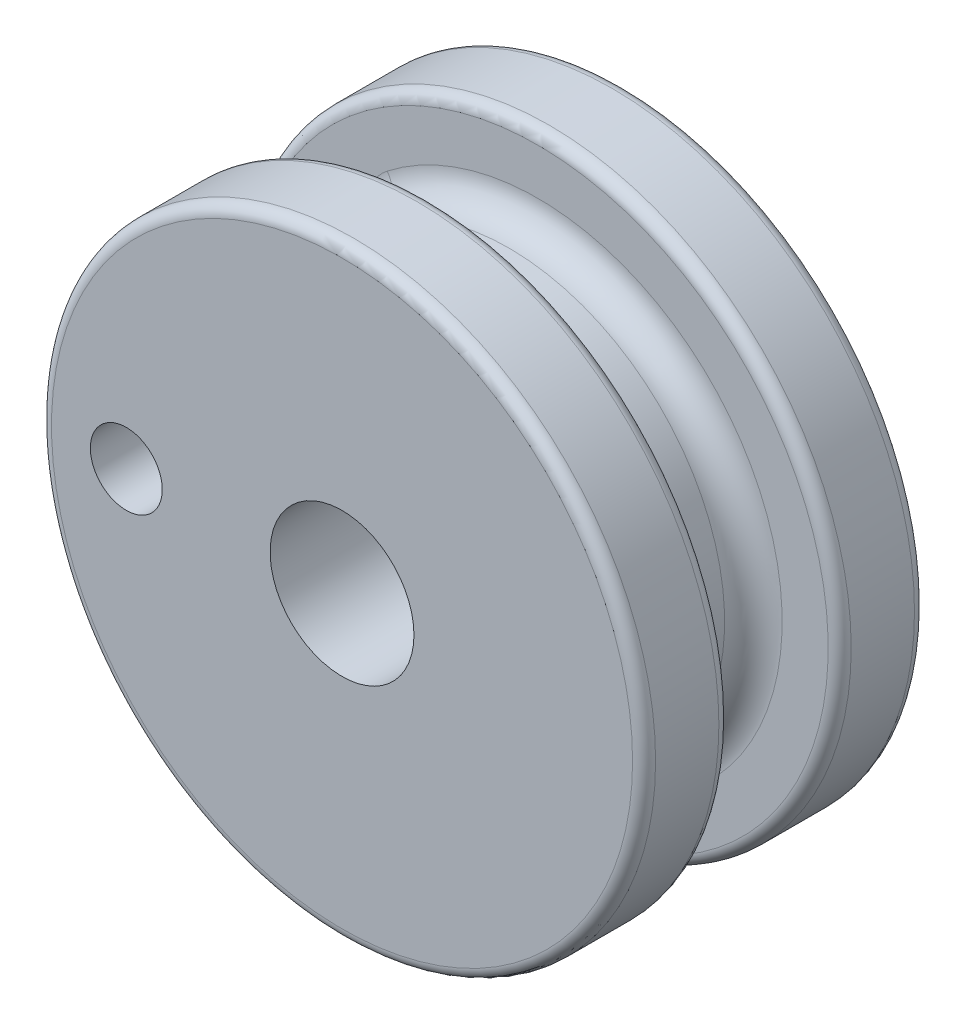
ISO-10303-21;
HEADER;
FILE_DESCRIPTION(('STEP AP214'),'2;1');
FILE_NAME('part.step','',(''),(''),'','','');
FILE_SCHEMA(('AUTOMOTIVE_DESIGN { 1 0 10303 214 1 1 1 1 }'));
ENDSEC;
DATA;
#1=APPLICATION_CONTEXT('core data for automotive mechanical design processes');
#2=APPLICATION_PROTOCOL_DEFINITION('international standard','automotive_design',2000,#1);
#3=PRODUCT_CONTEXT('',#1,'mechanical');
#4=PRODUCT('Part','Part','',(#3));
#5=PRODUCT_RELATED_PRODUCT_CATEGORY('part','',(#4));
#6=PRODUCT_DEFINITION_FORMATION('','',#4);
#7=PRODUCT_DEFINITION_CONTEXT('part definition',#1,'design');
#8=PRODUCT_DEFINITION('design','',#6,#7);
#9=PRODUCT_DEFINITION_SHAPE('','',#8);
#10=(LENGTH_UNIT() NAMED_UNIT(*) SI_UNIT(.MILLI.,.METRE.));
#11=(NAMED_UNIT(*) PLANE_ANGLE_UNIT() SI_UNIT($,.RADIAN.));
#12=(NAMED_UNIT(*) SI_UNIT($,.STERADIAN.) SOLID_ANGLE_UNIT());
#13=UNCERTAINTY_MEASURE_WITH_UNIT(LENGTH_MEASURE(1.E-05),#10,'distance_accuracy_value','');
#14=(GEOMETRIC_REPRESENTATION_CONTEXT(3) GLOBAL_UNCERTAINTY_ASSIGNED_CONTEXT((#13)) GLOBAL_UNIT_ASSIGNED_CONTEXT((#10,
#11,#12)) REPRESENTATION_CONTEXT('',''));
#15=CARTESIAN_POINT('',(0.,0.,0.));
#16=DIRECTION('',(0.,0.,1.));
#17=DIRECTION('',(1.,0.,0.));
#18=AXIS2_PLACEMENT_3D('',#15,#16,#17);
#19=CARTESIAN_POINT('',(-47.7047335344485,0.,-21.463));
#20=DIRECTION('',(0.,0.,-1.));
#21=DIRECTION('',(-1.,0.,0.));
#22=AXIS2_PLACEMENT_3D('',#19,#20,#21);
#23=CYLINDRICAL_SURFACE('',#22,1.5875);
#24=CARTESIAN_POINT('',(-47.7047335344485,0.,-21.463));
#25=DIRECTION('',(0.,0.,-1.));
#26=DIRECTION('',(-1.,0.,0.));
#27=AXIS2_PLACEMENT_3D('',#24,#25,#26);
#28=CIRCLE('',#27,1.5875);
#29=CARTESIAN_POINT('',(-49.2922335344485,0.,-21.463));
#30=VERTEX_POINT('',#29);
#31=EDGE_CURVE('E215',#30,#30,#28,.T.);
#32=ORIENTED_EDGE('',*,*,#31,.T.);
#33=EDGE_LOOP('',(#32));
#34=FACE_BOUND('',#33,.T.);
#35=CARTESIAN_POINT('',(-47.7047335344485,0.,-17.653));
#36=DIRECTION('',(0.,0.,-1.));
#37=DIRECTION('',(-1.,0.,0.));
#38=AXIS2_PLACEMENT_3D('',#35,#36,#37);
#39=CIRCLE('',#38,1.5875);
#40=CARTESIAN_POINT('',(-49.2922335344485,0.,-17.653));
#41=VERTEX_POINT('',#40);
#42=EDGE_CURVE('E301',#41,#41,#39,.T.);
#43=ORIENTED_EDGE('',*,*,#42,.F.);
#44=EDGE_LOOP('',(#43));
#45=FACE_BOUND('',#44,.T.);
#46=ADVANCED_FACE('F44',(#34,#45),#23,.F.);
#47=CARTESIAN_POINT('',(-38.1797335344485,0.,-9.017));
#48=DIRECTION('',(0.,0.,-1.));
#49=DIRECTION('',(-1.,0.,0.));
#50=AXIS2_PLACEMENT_3D('',#47,#48,#49);
#51=CYLINDRICAL_SURFACE('',#50,9.525);
#52=CARTESIAN_POINT('',(-38.1797335344485,0.,-16.383));
#53=DIRECTION('',(0.,0.,-1.));
#54=DIRECTION('',(-1.,0.,0.));
#55=AXIS2_PLACEMENT_3D('',#52,#53,#54);
#56=CIRCLE('',#55,9.525);
#57=CARTESIAN_POINT('',(-44.041271995987,-7.5078620035204,-16.383));
#58=VERTEX_POINT('',#57);
#59=CARTESIAN_POINT('',(-44.041271995987,7.50786200352041,-16.383));
#60=VERTEX_POINT('',#59);
#61=EDGE_CURVE('E157',#58,#60,#56,.F.);
#62=ORIENTED_EDGE('',*,*,#61,.T.);
#63=DIRECTION('',(0.,0.,-1.));
#64=VECTOR('',#63,1.);
#65=CARTESIAN_POINT('',(-44.041271995987,7.50786200352041,-9.017));
#66=LINE('',#65,#64);
#67=CARTESIAN_POINT('',(-44.041271995987,7.50786200352041,-14.097));
#68=VERTEX_POINT('',#67);
#69=EDGE_CURVE('E161',#60,#68,#66,.F.);
#70=ORIENTED_EDGE('',*,*,#69,.T.);
#71=CARTESIAN_POINT('',(-38.1797335344485,0.,-14.097));
#72=DIRECTION('',(0.,0.,1.));
#73=DIRECTION('',(1.,0.,0.));
#74=AXIS2_PLACEMENT_3D('',#71,#72,#73);
#75=CIRCLE('',#74,9.525);
#76=CARTESIAN_POINT('',(-44.041271995987,-7.5078620035204,-14.097));
#77=VERTEX_POINT('',#76);
#78=EDGE_CURVE('E150',#68,#77,#75,.F.);
#79=ORIENTED_EDGE('',*,*,#78,.T.);
#80=DIRECTION('',(0.,0.,-1.));
#81=VECTOR('',#80,1.);
#82=CARTESIAN_POINT('',(-44.041271995987,-7.5078620035204,-9.017));
#83=LINE('',#82,#81);
#84=EDGE_CURVE('E144',#77,#58,#83,.T.);
#85=ORIENTED_EDGE('',*,*,#84,.T.);
#86=EDGE_LOOP('',(#62,#70,#79,#85));
#87=FACE_BOUND('',#86,.T.);
#88=ADVANCED_FACE('F274',(#87),#51,.T.);
#89=CARTESIAN_POINT('',(-38.1797335344485,0.,-9.017));
#90=DIRECTION('',(0.,0.,1.));
#91=DIRECTION('',(1.,0.,0.));
#92=AXIS2_PLACEMENT_3D('',#89,#90,#91);
#93=PLANE('',#92);
#94=CARTESIAN_POINT('',(-38.1797335344485,0.,-9.017));
#95=DIRECTION('',(0.,0.,1.));
#96=DIRECTION('',(1.,0.,0.));
#97=AXIS2_PLACEMENT_3D('',#94,#95,#96);
#98=CIRCLE('',#97,12.827);
#99=CARTESIAN_POINT('',(-25.3527335344485,0.,-9.017));
#100=VERTEX_POINT('',#99);
#101=EDGE_CURVE('E184',#100,#100,#98,.T.);
#102=ORIENTED_EDGE('',*,*,#101,.T.);
#103=EDGE_LOOP('',(#102));
#104=FACE_BOUND('',#103,.T.);
#105=CARTESIAN_POINT('',(-47.7047335344485,0.,-9.01699999999999));
#106=DIRECTION('',(0.,0.,-1.));
#107=DIRECTION('',(-1.,0.,0.));
#108=AXIS2_PLACEMENT_3D('',#105,#106,#107);
#109=CIRCLE('',#108,1.5875);
#110=CARTESIAN_POINT('',(-49.2922335344485,0.,-9.01699999999999));
#111=VERTEX_POINT('',#110);
#112=EDGE_CURVE('E295',#111,#111,#109,.T.);
#113=ORIENTED_EDGE('',*,*,#112,.T.);
#114=EDGE_LOOP('',(#113));
#115=FACE_BOUND('',#114,.T.);
#116=CARTESIAN_POINT('',(-38.1797335344485,0.,-9.017));
#117=DIRECTION('',(0.,0.,1.));
#118=DIRECTION('',(1.,0.,0.));
#119=AXIS2_PLACEMENT_3D('',#116,#117,#118);
#120=CIRCLE('',#119,3.175);
#121=CARTESIAN_POINT('',(-35.0047335344485,0.,-9.017));
#122=VERTEX_POINT('',#121);
#123=EDGE_CURVE('E127',#122,#122,#120,.T.);
#124=ORIENTED_EDGE('',*,*,#123,.F.);
#125=EDGE_LOOP('',(#124));
#126=FACE_BOUND('',#125,.T.);
#127=ADVANCED_FACE('F279',(#104,#115,#126),#93,.T.);
#128=CARTESIAN_POINT('',(-38.1797335344485,0.,-21.463));
#129=DIRECTION('',(0.,0.,1.));
#130=DIRECTION('',(1.,0.,0.));
#131=AXIS2_PLACEMENT_3D('',#128,#129,#130);
#132=PLANE('',#131);
#133=CARTESIAN_POINT('',(-38.1797335344485,0.,-21.463));
#134=DIRECTION('',(0.,0.,1.));
#135=DIRECTION('',(1.,0.,0.));
#136=AXIS2_PLACEMENT_3D('',#133,#134,#135);
#137=CIRCLE('',#136,12.827);
#138=CARTESIAN_POINT('',(-25.3527335344485,0.,-21.463));
#139=VERTEX_POINT('',#138);
#140=EDGE_CURVE('E53',#139,#139,#137,.F.);
#141=ORIENTED_EDGE('',*,*,#140,.T.);
#142=EDGE_LOOP('',(#141));
#143=FACE_BOUND('',#142,.T.);
#144=ORIENTED_EDGE('',*,*,#31,.F.);
#145=EDGE_LOOP('',(#144));
#146=FACE_BOUND('',#145,.T.);
#147=CARTESIAN_POINT('',(-38.1797335344485,0.,-21.463));
#148=DIRECTION('',(0.,0.,1.));
#149=DIRECTION('',(1.,0.,0.));
#150=AXIS2_PLACEMENT_3D('',#147,#148,#149);
#151=CIRCLE('',#150,3.175);
#152=CARTESIAN_POINT('',(-35.0047335344485,0.,-21.463));
#153=VERTEX_POINT('',#152);
#154=EDGE_CURVE('E305',#153,#153,#151,.T.);
#155=ORIENTED_EDGE('',*,*,#154,.T.);
#156=EDGE_LOOP('',(#155));
#157=FACE_BOUND('',#156,.T.);
#158=ADVANCED_FACE('F243',(#143,#146,#157),#132,.F.);
#159=CARTESIAN_POINT('',(-38.1797335344485,0.,-9.017));
#160=DIRECTION('',(0.,0.,-1.));
#161=DIRECTION('',(-1.,0.,0.));
#162=AXIS2_PLACEMENT_3D('',#159,#160,#161);
#163=CYLINDRICAL_SURFACE('',#162,3.175);
#164=ORIENTED_EDGE('',*,*,#154,.F.);
#165=EDGE_LOOP('',(#164));
#166=FACE_BOUND('',#165,.T.);
#167=ORIENTED_EDGE('',*,*,#123,.T.);
#168=EDGE_LOOP('',(#167));
#169=FACE_BOUND('',#168,.T.);
#170=ADVANCED_FACE('F318',(#166,#169),#163,.F.);
#171=CARTESIAN_POINT('',(-38.1797335344485,0.,-12.827));
#172=DIRECTION('',(0.,0.,1.));
#173=DIRECTION('',(1.,0.,0.));
#174=AXIS2_PLACEMENT_3D('',#171,#172,#173);
#175=PLANE('',#174);
#176=CARTESIAN_POINT('',(-38.1797335344485,0.,-12.827));
#177=DIRECTION('',(0.,0.,1.));
#178=DIRECTION('',(1.,0.,0.));
#179=AXIS2_PLACEMENT_3D('',#176,#177,#178);
#180=CIRCLE('',#179,12.827);
#181=CARTESIAN_POINT('',(-25.3527335344485,0.,-12.827));
#182=VERTEX_POINT('',#181);
#183=EDGE_CURVE('E227',#182,#182,#180,.F.);
#184=ORIENTED_EDGE('',*,*,#183,.T.);
#185=EDGE_LOOP('',(#184));
#186=FACE_BOUND('',#185,.T.);
#187=CARTESIAN_POINT('',(-43.2597335344485,-6.50681373638435,-12.827));
#188=DIRECTION('',(0.,0.,1.));
#189=DIRECTION('',(1.,0.,0.));
#190=AXIS2_PLACEMENT_3D('',#187,#188,#189);
#191=CIRCLE('',#190,2.54);
#192=CARTESIAN_POINT('',(-44.8228104575254,-8.50891027065646,-12.827));
#193=VERTEX_POINT('',#192);
#194=CARTESIAN_POINT('',(-45.7997335344485,-6.50681373638435,-12.827));
#195=VERTEX_POINT('',#194);
#196=EDGE_CURVE('E163',#193,#195,#191,.F.);
#197=ORIENTED_EDGE('',*,*,#196,.F.);
#198=CARTESIAN_POINT('',(-38.1797335344485,0.,-12.827));
#199=DIRECTION('',(0.,0.,1.));
#200=DIRECTION('',(1.,0.,0.));
#201=AXIS2_PLACEMENT_3D('',#198,#199,#200);
#202=CIRCLE('',#201,10.795);
#203=CARTESIAN_POINT('',(-44.8228104575254,8.50891027065646,-12.827));
#204=VERTEX_POINT('',#203);
#205=EDGE_CURVE('E172',#193,#204,#202,.T.);
#206=ORIENTED_EDGE('',*,*,#205,.T.);
#207=CARTESIAN_POINT('',(-43.2597335344485,6.50681373638435,-12.827));
#208=DIRECTION('',(0.,0.,1.));
#209=DIRECTION('',(1.,0.,0.));
#210=AXIS2_PLACEMENT_3D('',#207,#208,#209);
#211=CIRCLE('',#210,2.54);
#212=CARTESIAN_POINT('',(-45.7997335344485,6.50681373638435,-12.827));
#213=VERTEX_POINT('',#212);
#214=EDGE_CURVE('E170',#213,#204,#211,.F.);
#215=ORIENTED_EDGE('',*,*,#214,.F.);
#216=DIRECTION('',(0.,1.,0.));
#217=VECTOR('',#216,1.);
#218=CARTESIAN_POINT('',(-45.7997335344485,-7.09951582856183,-12.827));
#219=LINE('',#218,#217);
#220=EDGE_CURVE('E167',#213,#195,#219,.F.);
#221=ORIENTED_EDGE('',*,*,#220,.T.);
#222=EDGE_LOOP('',(#197,#206,#215,#221));
#223=FACE_BOUND('',#222,.T.);
#224=CARTESIAN_POINT('',(-47.7047335344485,0.,-12.827));
#225=DIRECTION('',(0.,0.,1.));
#226=DIRECTION('',(1.,0.,0.));
#227=AXIS2_PLACEMENT_3D('',#224,#225,#226);
#228=CIRCLE('',#227,1.5875);
#229=CARTESIAN_POINT('',(-46.1172335344485,0.,-12.827));
#230=VERTEX_POINT('',#229);
#231=EDGE_CURVE('E298',#230,#230,#228,.T.);
#232=ORIENTED_EDGE('',*,*,#231,.T.);
#233=EDGE_LOOP('',(#232));
#234=FACE_BOUND('',#233,.T.);
#235=ADVANCED_FACE('F269',(#186,#223,#234),#175,.F.);
#236=CARTESIAN_POINT('',(-38.1797335344485,0.,-12.827));
#237=DIRECTION('',(0.,0.,1.));
#238=DIRECTION('',(1.,0.,0.));
#239=AXIS2_PLACEMENT_3D('',#236,#237,#238);
#240=CYLINDRICAL_SURFACE('',#239,13.335);
#241=CARTESIAN_POINT('',(-38.1797335344485,0.,-9.525));
#242=DIRECTION('',(0.,0.,1.));
#243=DIRECTION('',(1.,0.,0.));
#244=AXIS2_PLACEMENT_3D('',#241,#242,#243);
#245=CIRCLE('',#244,13.335);
#246=CARTESIAN_POINT('',(-24.8447335344485,0.,-9.525));
#247=VERTEX_POINT('',#246);
#248=EDGE_CURVE('E223',#247,#247,#245,.F.);
#249=ORIENTED_EDGE('',*,*,#248,.T.);
#250=EDGE_LOOP('',(#249));
#251=FACE_BOUND('',#250,.T.);
#252=CARTESIAN_POINT('',(-38.1797335344485,0.,-12.319));
#253=DIRECTION('',(0.,0.,1.));
#254=DIRECTION('',(1.,0.,0.));
#255=AXIS2_PLACEMENT_3D('',#252,#253,#254);
#256=CIRCLE('',#255,13.335);
#257=CARTESIAN_POINT('',(-24.8447335344485,0.,-12.319));
#258=VERTEX_POINT('',#257);
#259=EDGE_CURVE('E219',#258,#258,#256,.T.);
#260=ORIENTED_EDGE('',*,*,#259,.T.);
#261=EDGE_LOOP('',(#260));
#262=FACE_BOUND('',#261,.T.);
#263=ADVANCED_FACE('F264',(#251,#262),#240,.T.);
#264=CARTESIAN_POINT('',(-38.1797335344485,0.,-17.653));
#265=DIRECTION('',(0.,0.,-1.));
#266=DIRECTION('',(1.,0.,0.));
#267=AXIS2_PLACEMENT_3D('',#264,#265,#266);
#268=PLANE('',#267);
#269=CARTESIAN_POINT('',(-38.1797335344485,0.,-17.653));
#270=DIRECTION('',(0.,0.,-1.));
#271=DIRECTION('',(-1.,0.,0.));
#272=AXIS2_PLACEMENT_3D('',#269,#270,#271);
#273=CIRCLE('',#272,12.827);
#274=CARTESIAN_POINT('',(-51.0067335344485,0.,-17.653));
#275=VERTEX_POINT('',#274);
#276=EDGE_CURVE('E12',#275,#275,#273,.F.);
#277=ORIENTED_EDGE('',*,*,#276,.T.);
#278=EDGE_LOOP('',(#277));
#279=FACE_BOUND('',#278,.T.);
#280=CARTESIAN_POINT('',(-43.2597335344485,6.50681373638435,-17.653));
#281=DIRECTION('',(0.,0.,-1.));
#282=DIRECTION('',(-1.,0.,0.));
#283=AXIS2_PLACEMENT_3D('',#280,#281,#282);
#284=CIRCLE('',#283,2.54);
#285=CARTESIAN_POINT('',(-44.8228104575254,8.50891027065646,-17.653));
#286=VERTEX_POINT('',#285);
#287=CARTESIAN_POINT('',(-45.7997335344485,6.50681373638435,-17.653));
#288=VERTEX_POINT('',#287);
#289=EDGE_CURVE('E116',#286,#288,#284,.F.);
#290=ORIENTED_EDGE('',*,*,#289,.F.);
#291=CARTESIAN_POINT('',(-38.1797335344485,0.,-17.653));
#292=DIRECTION('',(0.,0.,-1.));
#293=DIRECTION('',(-1.,0.,0.));
#294=AXIS2_PLACEMENT_3D('',#291,#292,#293);
#295=CIRCLE('',#294,10.795);
#296=CARTESIAN_POINT('',(-44.8228104575254,-8.50891027065646,-17.653));
#297=VERTEX_POINT('',#296);
#298=EDGE_CURVE('E121',#286,#297,#295,.T.);
#299=ORIENTED_EDGE('',*,*,#298,.T.);
#300=CARTESIAN_POINT('',(-43.2597335344485,-6.50681373638435,-17.653));
#301=DIRECTION('',(0.,0.,-1.));
#302=DIRECTION('',(-1.,0.,0.));
#303=AXIS2_PLACEMENT_3D('',#300,#301,#302);
#304=CIRCLE('',#303,2.54);
#305=CARTESIAN_POINT('',(-45.7997335344485,-6.50681373638435,-17.653));
#306=VERTEX_POINT('',#305);
#307=EDGE_CURVE('E145',#306,#297,#304,.F.);
#308=ORIENTED_EDGE('',*,*,#307,.F.);
#309=DIRECTION('',(0.,1.,0.));
#310=VECTOR('',#309,1.);
#311=CARTESIAN_POINT('',(-45.7997335344485,7.09951582856184,-17.653));
#312=LINE('',#311,#310);
#313=EDGE_CURVE('E123',#306,#288,#312,.T.);
#314=ORIENTED_EDGE('',*,*,#313,.T.);
#315=EDGE_LOOP('',(#290,#299,#308,#314));
#316=FACE_BOUND('',#315,.T.);
#317=ORIENTED_EDGE('',*,*,#42,.T.);
#318=EDGE_LOOP('',(#317));
#319=FACE_BOUND('',#318,.T.);
#320=ADVANCED_FACE('F118',(#279,#316,#319),#268,.F.);
#321=CARTESIAN_POINT('',(-38.1797335344485,0.,-17.653));
#322=DIRECTION('',(0.,0.,-1.));
#323=DIRECTION('',(-1.,0.,0.));
#324=AXIS2_PLACEMENT_3D('',#321,#322,#323);
#325=CYLINDRICAL_SURFACE('',#324,13.335);
#326=CARTESIAN_POINT('',(-38.1797335344485,0.,-20.955));
#327=DIRECTION('',(0.,0.,1.));
#328=DIRECTION('',(1.,0.,0.));
#329=AXIS2_PLACEMENT_3D('',#326,#327,#328);
#330=CIRCLE('',#329,13.335);
#331=CARTESIAN_POINT('',(-24.8447335344485,0.,-20.955));
#332=VERTEX_POINT('',#331);
#333=EDGE_CURVE('E235',#332,#332,#330,.T.);
#334=ORIENTED_EDGE('',*,*,#333,.T.);
#335=EDGE_LOOP('',(#334));
#336=FACE_BOUND('',#335,.T.);
#337=CARTESIAN_POINT('',(-38.1797335344485,0.,-18.161));
#338=DIRECTION('',(0.,0.,-1.));
#339=DIRECTION('',(-1.,0.,0.));
#340=AXIS2_PLACEMENT_3D('',#337,#338,#339);
#341=CIRCLE('',#340,13.335);
#342=CARTESIAN_POINT('',(-51.5147335344485,0.,-18.161));
#343=VERTEX_POINT('',#342);
#344=EDGE_CURVE('E231',#343,#343,#341,.T.);
#345=ORIENTED_EDGE('',*,*,#344,.T.);
#346=EDGE_LOOP('',(#345));
#347=FACE_BOUND('',#346,.T.);
#348=ADVANCED_FACE('F252',(#336,#347),#325,.T.);
#349=ORIENTED_EDGE('',*,*,#112,.F.);
#350=EDGE_LOOP('',(#349));
#351=FACE_BOUND('',#350,.T.);
#352=ORIENTED_EDGE('',*,*,#231,.F.);
#353=EDGE_LOOP('',(#352));
#354=FACE_BOUND('',#353,.T.);
#355=ADVANCED_FACE('F255',(#351,#354),#23,.F.);
#356=CARTESIAN_POINT('',(-44.5297335344485,7.09951582856184,-33.2072598666732));
#357=DIRECTION('',(1.,0.,0.));
#358=DIRECTION('',(0.,1.,0.));
#359=AXIS2_PLACEMENT_3D('',#356,#357,#358);
#360=PLANE('',#359);
#361=DIRECTION('',(0.,0.,-1.));
#362=VECTOR('',#361,1.);
#363=CARTESIAN_POINT('',(-44.5297335344485,6.50681373638435,-33.2072598666732));
#364=LINE('',#363,#362);
#365=CARTESIAN_POINT('',(-44.5297335344485,6.50681373638435,-14.097));
#366=VERTEX_POINT('',#365);
#367=CARTESIAN_POINT('',(-44.5297335344485,6.50681373638435,-16.383));
#368=VERTEX_POINT('',#367);
#369=EDGE_CURVE('E60',#366,#368,#364,.T.);
#370=ORIENTED_EDGE('',*,*,#369,.T.);
#371=DIRECTION('',(0.,1.,0.));
#372=VECTOR('',#371,1.);
#373=CARTESIAN_POINT('',(-44.5297335344485,-7.09951582856183,-16.383));
#374=LINE('',#373,#372);
#375=CARTESIAN_POINT('',(-44.5297335344485,-6.50681373638435,-16.383));
#376=VERTEX_POINT('',#375);
#377=EDGE_CURVE('E182',#368,#376,#374,.F.);
#378=ORIENTED_EDGE('',*,*,#377,.T.);
#379=DIRECTION('',(0.,0.,-1.));
#380=VECTOR('',#379,1.);
#381=CARTESIAN_POINT('',(-44.5297335344485,-6.50681373638435,-33.2072598666732));
#382=LINE('',#381,#380);
#383=CARTESIAN_POINT('',(-44.5297335344485,-6.50681373638435,-14.097));
#384=VERTEX_POINT('',#383);
#385=EDGE_CURVE('E176',#376,#384,#382,.F.);
#386=ORIENTED_EDGE('',*,*,#385,.T.);
#387=DIRECTION('',(0.,1.,0.));
#388=VECTOR('',#387,1.);
#389=CARTESIAN_POINT('',(-44.5297335344485,7.09951582856184,-14.097));
#390=LINE('',#389,#388);
#391=EDGE_CURVE('E65',#384,#366,#390,.T.);
#392=ORIENTED_EDGE('',*,*,#391,.T.);
#393=EDGE_LOOP('',(#370,#378,#386,#392));
#394=FACE_BOUND('',#393,.T.);
#395=ADVANCED_FACE('F286',(#394),#360,.F.);
#396=CARTESIAN_POINT('',(-45.7997335344485,7.09951582856184,-14.097));
#397=DIRECTION('',(0.,-1.,0.));
#398=DIRECTION('',(1.,0.,0.));
#399=AXIS2_PLACEMENT_3D('',#396,#397,#398);
#400=CYLINDRICAL_SURFACE('',#399,1.27);
#401=CARTESIAN_POINT('',(-45.7997335344485,-6.50681373638435,-14.097));
#402=DIRECTION('',(0.,1.,0.));
#403=DIRECTION('',(-1.,0.,0.));
#404=AXIS2_PLACEMENT_3D('',#401,#402,#403);
#405=CIRCLE('',#404,1.27);
#406=EDGE_CURVE('E205',#195,#384,#405,.T.);
#407=ORIENTED_EDGE('',*,*,#406,.F.);
#408=ORIENTED_EDGE('',*,*,#220,.F.);
#409=CARTESIAN_POINT('',(-45.7997335344485,6.50681373638435,-14.097));
#410=DIRECTION('',(0.,-1.,0.));
#411=DIRECTION('',(1.,0.,0.));
#412=AXIS2_PLACEMENT_3D('',#409,#410,#411);
#413=CIRCLE('',#412,1.27);
#414=EDGE_CURVE('E209',#366,#213,#413,.T.);
#415=ORIENTED_EDGE('',*,*,#414,.F.);
#416=ORIENTED_EDGE('',*,*,#391,.F.);
#417=EDGE_LOOP('',(#407,#408,#415,#416));
#418=FACE_BOUND('',#417,.T.);
#419=ADVANCED_FACE('F291',(#418),#400,.F.);
#420=CARTESIAN_POINT('',(-38.1797335344485,0.,-14.097));
#421=DIRECTION('',(0.,0.,1.));
#422=DIRECTION('',(1.,0.,0.));
#423=AXIS2_PLACEMENT_3D('',#420,#421,#422);
#424=TOROIDAL_SURFACE('',#423,10.795,1.27);
#425=CARTESIAN_POINT('',(-44.8228104575254,8.50891027065646,-14.097));
#426=DIRECTION('',(0.788226981996894,0.615384615384613,0.));
#427=DIRECTION('',(-0.615384615384613,0.788226981996894,0.));
#428=AXIS2_PLACEMENT_3D('',#425,#426,#427);
#429=CIRCLE('',#428,1.27);
#430=EDGE_CURVE('E212',#204,#68,#429,.T.);
#431=ORIENTED_EDGE('',*,*,#430,.F.);
#432=ORIENTED_EDGE('',*,*,#205,.F.);
#433=CARTESIAN_POINT('',(-44.8228104575254,-8.50891027065645,-14.097));
#434=DIRECTION('',(0.788226981996894,-0.615384615384614,0.));
#435=DIRECTION('',(0.615384615384614,0.788226981996894,0.));
#436=AXIS2_PLACEMENT_3D('',#433,#434,#435);
#437=CIRCLE('',#436,1.27);
#438=EDGE_CURVE('E201',#77,#193,#437,.T.);
#439=ORIENTED_EDGE('',*,*,#438,.F.);
#440=ORIENTED_EDGE('',*,*,#78,.F.);
#441=EDGE_LOOP('',(#431,#432,#439,#440));
#442=FACE_BOUND('',#441,.T.);
#443=ADVANCED_FACE('F361',(#442),#424,.F.);
#444=CARTESIAN_POINT('',(-43.2597335344485,6.50681373638435,-14.097));
#445=DIRECTION('',(0.,0.,1.));
#446=DIRECTION('',(1.,0.,0.));
#447=AXIS2_PLACEMENT_3D('',#444,#445,#446);
#448=TOROIDAL_SURFACE('',#447,2.54,1.27);
#449=ORIENTED_EDGE('',*,*,#214,.T.);
#450=ORIENTED_EDGE('',*,*,#430,.T.);
#451=CARTESIAN_POINT('',(-43.2597335344485,6.50681373638435,-14.097));
#452=DIRECTION('',(0.,0.,1.));
#453=DIRECTION('',(1.,0.,0.));
#454=AXIS2_PLACEMENT_3D('',#451,#452,#453);
#455=CIRCLE('',#454,1.27);
#456=EDGE_CURVE('E198',#366,#68,#455,.F.);
#457=ORIENTED_EDGE('',*,*,#456,.F.);
#458=ORIENTED_EDGE('',*,*,#414,.T.);
#459=EDGE_LOOP('',(#449,#450,#457,#458));
#460=FACE_BOUND('',#459,.T.);
#461=ADVANCED_FACE('F357',(#460),#448,.F.);
#462=CARTESIAN_POINT('',(-43.2597335344485,-6.50681373638435,-14.097));
#463=DIRECTION('',(0.,0.,1.));
#464=DIRECTION('',(1.,0.,0.));
#465=AXIS2_PLACEMENT_3D('',#462,#463,#464);
#466=TOROIDAL_SURFACE('',#465,2.54,1.27);
#467=ORIENTED_EDGE('',*,*,#196,.T.);
#468=ORIENTED_EDGE('',*,*,#406,.T.);
#469=CARTESIAN_POINT('',(-43.2597335344485,-6.50681373638435,-14.097));
#470=DIRECTION('',(0.,0.,1.));
#471=DIRECTION('',(1.,0.,0.));
#472=AXIS2_PLACEMENT_3D('',#469,#470,#471);
#473=CIRCLE('',#472,1.27);
#474=EDGE_CURVE('E194',#77,#384,#473,.F.);
#475=ORIENTED_EDGE('',*,*,#474,.F.);
#476=ORIENTED_EDGE('',*,*,#438,.T.);
#477=EDGE_LOOP('',(#467,#468,#475,#476));
#478=FACE_BOUND('',#477,.T.);
#479=ADVANCED_FACE('F353',(#478),#466,.F.);
#480=CARTESIAN_POINT('',(-43.2597335344485,6.50681373638435,-9.017));
#481=DIRECTION('',(0.,0.,-1.));
#482=DIRECTION('',(-1.,0.,0.));
#483=AXIS2_PLACEMENT_3D('',#480,#481,#482);
#484=CYLINDRICAL_SURFACE('',#483,1.27);
#485=ORIENTED_EDGE('',*,*,#456,.T.);
#486=ORIENTED_EDGE('',*,*,#69,.F.);
#487=CARTESIAN_POINT('',(-43.2597335344485,6.50681373638435,-16.383));
#488=DIRECTION('',(0.,0.,-1.));
#489=DIRECTION('',(-1.,0.,0.));
#490=AXIS2_PLACEMENT_3D('',#487,#488,#489);
#491=CIRCLE('',#490,1.27);
#492=EDGE_CURVE('E133',#368,#60,#491,.T.);
#493=ORIENTED_EDGE('',*,*,#492,.F.);
#494=ORIENTED_EDGE('',*,*,#369,.F.);
#495=EDGE_LOOP('',(#485,#486,#493,#494));
#496=FACE_BOUND('',#495,.T.);
#497=ADVANCED_FACE('F349',(#496),#484,.T.);
#498=CARTESIAN_POINT('',(-45.7997335344485,0.,-16.383));
#499=DIRECTION('',(0.,-1.,0.));
#500=DIRECTION('',(1.,0.,0.));
#501=AXIS2_PLACEMENT_3D('',#498,#499,#500);
#502=CYLINDRICAL_SURFACE('',#501,1.27);
#503=CARTESIAN_POINT('',(-45.7997335344485,-6.50681373638435,-16.383));
#504=DIRECTION('',(0.,1.,0.));
#505=DIRECTION('',(-1.,0.,0.));
#506=AXIS2_PLACEMENT_3D('',#503,#504,#505);
#507=CIRCLE('',#506,1.27);
#508=EDGE_CURVE('E188',#376,#306,#507,.T.);
#509=ORIENTED_EDGE('',*,*,#508,.F.);
#510=ORIENTED_EDGE('',*,*,#377,.F.);
#511=CARTESIAN_POINT('',(-45.7997335344485,6.50681373638435,-16.383));
#512=DIRECTION('',(0.,-1.,0.));
#513=DIRECTION('',(1.,0.,0.));
#514=AXIS2_PLACEMENT_3D('',#511,#512,#513);
#515=CIRCLE('',#514,1.27);
#516=EDGE_CURVE('E191',#288,#368,#515,.T.);
#517=ORIENTED_EDGE('',*,*,#516,.F.);
#518=ORIENTED_EDGE('',*,*,#313,.F.);
#519=EDGE_LOOP('',(#509,#510,#517,#518));
#520=FACE_BOUND('',#519,.T.);
#521=ADVANCED_FACE('F345',(#520),#502,.F.);
#522=CARTESIAN_POINT('',(-43.2597335344485,-6.50681373638435,-9.017));
#523=DIRECTION('',(0.,0.,-1.));
#524=DIRECTION('',(-1.,0.,0.));
#525=AXIS2_PLACEMENT_3D('',#522,#523,#524);
#526=CYLINDRICAL_SURFACE('',#525,1.27);
#527=ORIENTED_EDGE('',*,*,#474,.T.);
#528=ORIENTED_EDGE('',*,*,#385,.F.);
#529=CARTESIAN_POINT('',(-43.2597335344485,-6.50681373638435,-16.383));
#530=DIRECTION('',(0.,0.,-1.));
#531=DIRECTION('',(-1.,0.,0.));
#532=AXIS2_PLACEMENT_3D('',#529,#530,#531);
#533=CIRCLE('',#532,1.27);
#534=EDGE_CURVE('E137',#58,#376,#533,.T.);
#535=ORIENTED_EDGE('',*,*,#534,.F.);
#536=ORIENTED_EDGE('',*,*,#84,.F.);
#537=EDGE_LOOP('',(#527,#528,#535,#536));
#538=FACE_BOUND('',#537,.T.);
#539=ADVANCED_FACE('F342',(#538),#526,.T.);
#540=CARTESIAN_POINT('',(-43.2597335344485,6.50681373638435,-16.383));
#541=DIRECTION('',(0.,0.,-1.));
#542=DIRECTION('',(-1.,0.,0.));
#543=AXIS2_PLACEMENT_3D('',#540,#541,#542);
#544=TOROIDAL_SURFACE('',#543,2.54,1.27);
#545=ORIENTED_EDGE('',*,*,#516,.T.);
#546=ORIENTED_EDGE('',*,*,#492,.T.);
#547=CARTESIAN_POINT('',(-44.8228104575254,8.50891027065646,-16.383));
#548=DIRECTION('',(0.788226981996893,0.615384615384614,0.));
#549=DIRECTION('',(-0.615384615384614,0.788226981996893,0.));
#550=AXIS2_PLACEMENT_3D('',#547,#548,#549);
#551=CIRCLE('',#550,1.27);
#552=EDGE_CURVE('E130',#286,#60,#551,.F.);
#553=ORIENTED_EDGE('',*,*,#552,.F.);
#554=ORIENTED_EDGE('',*,*,#289,.T.);
#555=EDGE_LOOP('',(#545,#546,#553,#554));
#556=FACE_BOUND('',#555,.T.);
#557=ADVANCED_FACE('F131',(#556),#544,.F.);
#558=CARTESIAN_POINT('',(-43.2597335344485,-6.50681373638435,-16.383));
#559=DIRECTION('',(0.,0.,-1.));
#560=DIRECTION('',(-1.,0.,0.));
#561=AXIS2_PLACEMENT_3D('',#558,#559,#560);
#562=TOROIDAL_SURFACE('',#561,2.54,1.27);
#563=ORIENTED_EDGE('',*,*,#508,.T.);
#564=ORIENTED_EDGE('',*,*,#307,.T.);
#565=CARTESIAN_POINT('',(-44.8228104575254,-8.50891027065646,-16.383));
#566=DIRECTION('',(0.788226981996894,-0.615384615384613,0.));
#567=DIRECTION('',(0.615384615384613,0.788226981996894,0.));
#568=AXIS2_PLACEMENT_3D('',#565,#566,#567);
#569=CIRCLE('',#568,1.27);
#570=EDGE_CURVE('E138',#58,#297,#569,.F.);
#571=ORIENTED_EDGE('',*,*,#570,.F.);
#572=ORIENTED_EDGE('',*,*,#534,.T.);
#573=EDGE_LOOP('',(#563,#564,#571,#572));
#574=FACE_BOUND('',#573,.T.);
#575=ADVANCED_FACE('F336',(#574),#562,.F.);
#576=CARTESIAN_POINT('',(-38.1797335344485,0.,-16.383));
#577=DIRECTION('',(0.,0.,-1.));
#578=DIRECTION('',(-1.,0.,0.));
#579=AXIS2_PLACEMENT_3D('',#576,#577,#578);
#580=TOROIDAL_SURFACE('',#579,10.795,1.27);
#581=ORIENTED_EDGE('',*,*,#552,.T.);
#582=ORIENTED_EDGE('',*,*,#61,.F.);
#583=ORIENTED_EDGE('',*,*,#570,.T.);
#584=ORIENTED_EDGE('',*,*,#298,.F.);
#585=EDGE_LOOP('',(#581,#582,#583,#584));
#586=FACE_BOUND('',#585,.T.);
#587=ADVANCED_FACE('F140',(#586),#580,.F.);
#588=CARTESIAN_POINT('',(-38.1797335344485,0.,-9.525));
#589=DIRECTION('',(0.,0.,1.));
#590=DIRECTION('',(1.,0.,0.));
#591=AXIS2_PLACEMENT_3D('',#588,#589,#590);
#592=TOROIDAL_SURFACE('',#591,12.827,0.508);
#593=ORIENTED_EDGE('',*,*,#248,.F.);
#594=EDGE_LOOP('',(#593));
#595=FACE_BOUND('',#594,.T.);
#596=ORIENTED_EDGE('',*,*,#101,.F.);
#597=EDGE_LOOP('',(#596));
#598=FACE_BOUND('',#597,.T.);
#599=ADVANCED_FACE('F335',(#595,#598),#592,.T.);
#600=CARTESIAN_POINT('',(-38.1797335344485,0.,-12.319));
#601=DIRECTION('',(0.,0.,1.));
#602=DIRECTION('',(1.,0.,0.));
#603=AXIS2_PLACEMENT_3D('',#600,#601,#602);
#604=TOROIDAL_SURFACE('',#603,12.827,0.508);
#605=ORIENTED_EDGE('',*,*,#183,.F.);
#606=EDGE_LOOP('',(#605));
#607=FACE_BOUND('',#606,.T.);
#608=ORIENTED_EDGE('',*,*,#259,.F.);
#609=EDGE_LOOP('',(#608));
#610=FACE_BOUND('',#609,.T.);
#611=ADVANCED_FACE('F249',(#607,#610),#604,.T.);
#612=CARTESIAN_POINT('',(-38.1797335344485,0.,-20.955));
#613=DIRECTION('',(0.,0.,1.));
#614=DIRECTION('',(1.,0.,0.));
#615=AXIS2_PLACEMENT_3D('',#612,#613,#614);
#616=TOROIDAL_SURFACE('',#615,12.827,0.508);
#617=ORIENTED_EDGE('',*,*,#140,.F.);
#618=EDGE_LOOP('',(#617));
#619=FACE_BOUND('',#618,.T.);
#620=ORIENTED_EDGE('',*,*,#333,.F.);
#621=EDGE_LOOP('',(#620));
#622=FACE_BOUND('',#621,.T.);
#623=ADVANCED_FACE('F246',(#619,#622),#616,.T.);
#624=CARTESIAN_POINT('',(-38.1797335344485,0.,-18.161));
#625=DIRECTION('',(0.,0.,-1.));
#626=DIRECTION('',(-1.,0.,0.));
#627=AXIS2_PLACEMENT_3D('',#624,#625,#626);
#628=TOROIDAL_SURFACE('',#627,12.827,0.508);
#629=ORIENTED_EDGE('',*,*,#344,.F.);
#630=EDGE_LOOP('',(#629));
#631=FACE_BOUND('',#630,.T.);
#632=ORIENTED_EDGE('',*,*,#276,.F.);
#633=EDGE_LOOP('',(#632));
#634=FACE_BOUND('',#633,.T.);
#635=ADVANCED_FACE('F46',(#631,#634),#628,.T.);
#636=CLOSED_SHELL('',(#46,#88,#127,#158,#170,#235,#263,#320,#348,#355,#395,#419,#443,#461,#479,
#497,#521,#539,#557,#575,#587,#599,#611,#623,#635));
#637=MANIFOLD_SOLID_BREP('B2',#636);
#638=ADVANCED_BREP_SHAPE_REPRESENTATION('',(#18,#637),#14);
#639=SHAPE_DEFINITION_REPRESENTATION(#9,#638);
ENDSEC;
END-ISO-10303-21;
